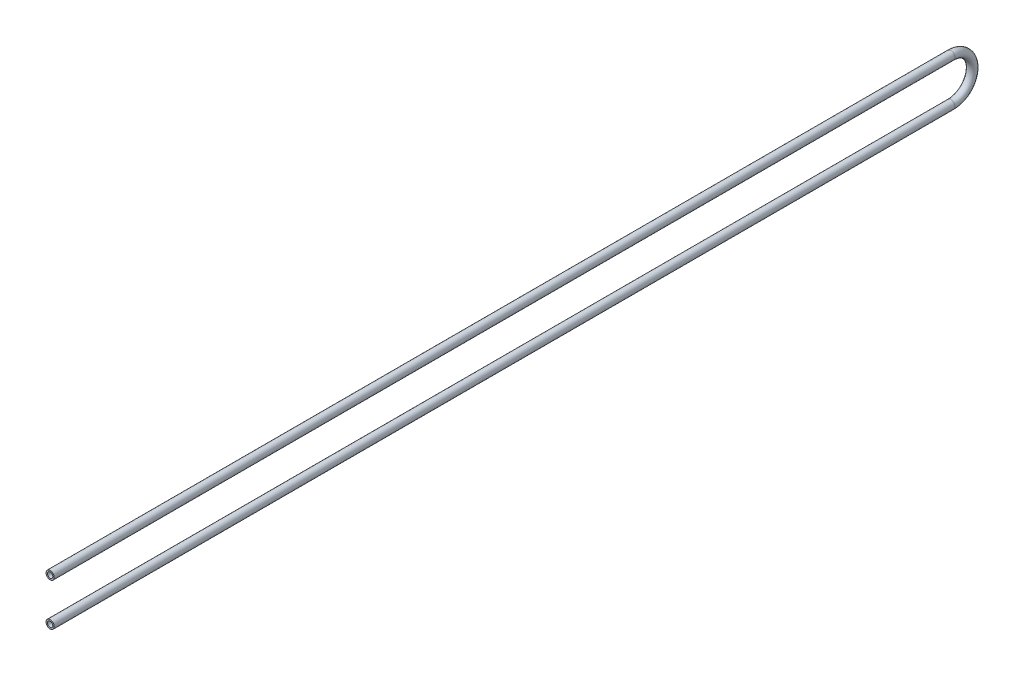
ISO-10303-21;
HEADER;
FILE_DESCRIPTION(('STEP AP214'),'2;1');
FILE_NAME('part.step','',(''),(''),'','','');
FILE_SCHEMA(('AUTOMOTIVE_DESIGN { 1 0 10303 214 1 1 1 1 }'));
ENDSEC;
DATA;
#1=APPLICATION_CONTEXT('core data for automotive mechanical design processes');
#2=APPLICATION_PROTOCOL_DEFINITION('international standard','automotive_design',2000,#1);
#3=PRODUCT_CONTEXT('',#1,'mechanical');
#4=PRODUCT('Part','Part','',(#3));
#5=PRODUCT_RELATED_PRODUCT_CATEGORY('part','',(#4));
#6=PRODUCT_DEFINITION_FORMATION('','',#4);
#7=PRODUCT_DEFINITION_CONTEXT('part definition',#1,'design');
#8=PRODUCT_DEFINITION('design','',#6,#7);
#9=PRODUCT_DEFINITION_SHAPE('','',#8);
#10=(LENGTH_UNIT() NAMED_UNIT(*) SI_UNIT(.MILLI.,.METRE.));
#11=(NAMED_UNIT(*) PLANE_ANGLE_UNIT() SI_UNIT($,.RADIAN.));
#12=(NAMED_UNIT(*) SI_UNIT($,.STERADIAN.) SOLID_ANGLE_UNIT());
#13=UNCERTAINTY_MEASURE_WITH_UNIT(LENGTH_MEASURE(1.E-05),#10,'distance_accuracy_value','');
#14=(GEOMETRIC_REPRESENTATION_CONTEXT(3) GLOBAL_UNCERTAINTY_ASSIGNED_CONTEXT((#13)) GLOBAL_UNIT_ASSIGNED_CONTEXT((#10,
#11,#12)) REPRESENTATION_CONTEXT('',''));
#15=CARTESIAN_POINT('',(0.,0.,0.));
#16=DIRECTION('',(0.,0.,1.));
#17=DIRECTION('',(1.,0.,0.));
#18=AXIS2_PLACEMENT_3D('',#15,#16,#17);
#19=CARTESIAN_POINT('',(0.,55.0000000000003,0.));
#20=DIRECTION('',(0.,0.,-1.));
#21=DIRECTION('',(0.,1.,0.));
#22=AXIS2_PLACEMENT_3D('',#19,#20,#21);
#23=CYLINDRICAL_SURFACE('',#22,10.65);
#24=CARTESIAN_POINT('',(0.,55.,-2325.));
#25=DIRECTION('',(0.,0.,1.));
#26=DIRECTION('',(1.,0.,0.));
#27=AXIS2_PLACEMENT_3D('',#24,#25,#26);
#28=CIRCLE('',#27,10.65);
#29=CARTESIAN_POINT('',(0.,65.65,-2325.));
#30=VERTEX_POINT('',#29);
#31=EDGE_CURVE('E55',#30,#30,#28,.T.);
#32=ORIENTED_EDGE('',*,*,#31,.T.);
#33=EDGE_LOOP('',(#32));
#34=FACE_BOUND('',#33,.T.);
#35=CARTESIAN_POINT('',(0.,55.0000000000003,0.));
#36=DIRECTION('',(0.,0.,1.));
#37=DIRECTION('',(1.,0.,0.));
#38=AXIS2_PLACEMENT_3D('',#35,#36,#37);
#39=CIRCLE('',#38,10.65);
#40=CARTESIAN_POINT('',(10.65,55.0000000000003,0.));
#41=VERTEX_POINT('',#40);
#42=EDGE_CURVE('E53',#41,#41,#39,.T.);
#43=ORIENTED_EDGE('',*,*,#42,.F.);
#44=EDGE_LOOP('',(#43));
#45=FACE_BOUND('',#44,.T.);
#46=ADVANCED_FACE('F32',(#34,#45),#23,.T.);
#47=CARTESIAN_POINT('',(0.,0.,-2325.));
#48=DIRECTION('',(-1.,0.,0.));
#49=DIRECTION('',(0.,0.,1.));
#50=AXIS2_PLACEMENT_3D('',#47,#48,#49);
#51=TOROIDAL_SURFACE('',#50,55.,10.65);
#52=CARTESIAN_POINT('',(0.,-55.,-2325.));
#53=DIRECTION('',(0.,0.,-1.));
#54=DIRECTION('',(1.,0.,0.));
#55=AXIS2_PLACEMENT_3D('',#52,#53,#54);
#56=CIRCLE('',#55,10.65);
#57=CARTESIAN_POINT('',(0.,-65.65,-2325.));
#58=VERTEX_POINT('',#57);
#59=EDGE_CURVE('E36',#58,#58,#56,.T.);
#60=CARTESIAN_POINT('',(0.,0.,-2325.));
#61=DIRECTION('',(-1.,0.,0.));
#62=DIRECTION('',(0.,0.,1.));
#63=AXIS2_PLACEMENT_3D('',#60,#61,#62);
#64=CIRCLE('',#63,65.65);
#65=EDGE_CURVE('',#30,#58,#64,.T.);
#66=ORIENTED_EDGE('',*,*,#31,.F.);
#67=ORIENTED_EDGE('',*,*,#59,.T.);
#68=ORIENTED_EDGE('',*,*,#65,.T.);
#69=ORIENTED_EDGE('',*,*,#65,.F.);
#70=EDGE_LOOP('',(#66,#68,#67,#69));
#71=FACE_BOUND('',#70,.T.);
#72=ADVANCED_FACE('F62',(#71),#51,.T.);
#73=CARTESIAN_POINT('',(0.,-55.,-2325.));
#74=DIRECTION('',(0.,0.,1.));
#75=DIRECTION('',(0.,-1.,0.));
#76=AXIS2_PLACEMENT_3D('',#73,#74,#75);
#77=CYLINDRICAL_SURFACE('',#76,10.65);
#78=CARTESIAN_POINT('',(0.,-55.0000000000003,0.));
#79=DIRECTION('',(0.,0.,-1.));
#80=DIRECTION('',(1.,0.,0.));
#81=AXIS2_PLACEMENT_3D('',#78,#79,#80);
#82=CIRCLE('',#81,10.65);
#83=CARTESIAN_POINT('',(10.65,-55.0000000000003,0.));
#84=VERTEX_POINT('',#83);
#85=EDGE_CURVE('E49',#84,#84,#82,.T.);
#86=ORIENTED_EDGE('',*,*,#85,.T.);
#87=EDGE_LOOP('',(#86));
#88=FACE_BOUND('',#87,.T.);
#89=ORIENTED_EDGE('',*,*,#59,.F.);
#90=EDGE_LOOP('',(#89));
#91=FACE_BOUND('',#90,.T.);
#92=ADVANCED_FACE('F34',(#88,#91),#77,.T.);
#93=CARTESIAN_POINT('',(0.,55.0000000000003,0.));
#94=DIRECTION('',(0.,0.,1.));
#95=DIRECTION('',(1.,0.,0.));
#96=AXIS2_PLACEMENT_3D('',#93,#94,#95);
#97=PLANE('',#96);
#98=CARTESIAN_POINT('',(0.,55.0000000000003,0.));
#99=DIRECTION('',(0.,0.,1.));
#100=DIRECTION('',(1.,0.,0.));
#101=AXIS2_PLACEMENT_3D('',#98,#99,#100);
#102=CIRCLE('',#101,6.92);
#103=CARTESIAN_POINT('',(6.92,55.0000000000003,0.));
#104=VERTEX_POINT('',#103);
#105=EDGE_CURVE('E52',#104,#104,#102,.F.);
#106=ORIENTED_EDGE('',*,*,#105,.T.);
#107=EDGE_LOOP('',(#106));
#108=FACE_BOUND('',#107,.T.);
#109=ORIENTED_EDGE('',*,*,#42,.T.);
#110=EDGE_LOOP('',(#109));
#111=FACE_BOUND('',#110,.T.);
#112=ADVANCED_FACE('F66',(#108,#111),#97,.T.);
#113=CARTESIAN_POINT('',(0.,-55.0000000000003,0.));
#114=DIRECTION('',(0.,0.,-1.));
#115=DIRECTION('',(1.,0.,0.));
#116=AXIS2_PLACEMENT_3D('',#113,#114,#115);
#117=PLANE('',#116);
#118=CARTESIAN_POINT('',(0.,-55.0000000000003,0.));
#119=DIRECTION('',(0.,0.,-1.));
#120=DIRECTION('',(1.,0.,0.));
#121=AXIS2_PLACEMENT_3D('',#118,#119,#120);
#122=CIRCLE('',#121,6.92);
#123=CARTESIAN_POINT('',(6.92,-55.0000000000003,0.));
#124=VERTEX_POINT('',#123);
#125=EDGE_CURVE('E10',#124,#124,#122,.F.);
#126=ORIENTED_EDGE('',*,*,#125,.F.);
#127=EDGE_LOOP('',(#126));
#128=FACE_BOUND('',#127,.T.);
#129=ORIENTED_EDGE('',*,*,#85,.F.);
#130=EDGE_LOOP('',(#129));
#131=FACE_BOUND('',#130,.T.);
#132=ADVANCED_FACE('F72',(#128,#131),#117,.F.);
#133=CARTESIAN_POINT('',(0.,55.0000000000003,0.));
#134=DIRECTION('',(0.,0.,-1.));
#135=DIRECTION('',(0.,1.,0.));
#136=AXIS2_PLACEMENT_3D('',#133,#134,#135);
#137=CYLINDRICAL_SURFACE('',#136,6.92);
#138=CARTESIAN_POINT('',(0.,55.,-2325.));
#139=DIRECTION('',(0.,0.,1.));
#140=DIRECTION('',(1.,0.,0.));
#141=AXIS2_PLACEMENT_3D('',#138,#139,#140);
#142=CIRCLE('',#141,6.92);
#143=CARTESIAN_POINT('',(0.,61.92,-2325.));
#144=VERTEX_POINT('',#143);
#145=EDGE_CURVE('E45',#144,#144,#142,.F.);
#146=ORIENTED_EDGE('',*,*,#145,.T.);
#147=EDGE_LOOP('',(#146));
#148=FACE_BOUND('',#147,.T.);
#149=ORIENTED_EDGE('',*,*,#105,.F.);
#150=EDGE_LOOP('',(#149));
#151=FACE_BOUND('',#150,.T.);
#152=ADVANCED_FACE('F82',(#148,#151),#137,.F.);
#153=CARTESIAN_POINT('',(0.,0.,-2325.));
#154=DIRECTION('',(-1.,0.,0.));
#155=DIRECTION('',(0.,0.,1.));
#156=AXIS2_PLACEMENT_3D('',#153,#154,#155);
#157=TOROIDAL_SURFACE('',#156,55.,6.92);
#158=CARTESIAN_POINT('',(0.,-55.,-2325.));
#159=DIRECTION('',(0.,0.,-1.));
#160=DIRECTION('',(1.,0.,0.));
#161=AXIS2_PLACEMENT_3D('',#158,#159,#160);
#162=CIRCLE('',#161,6.92);
#163=CARTESIAN_POINT('',(0.,-61.92,-2325.));
#164=VERTEX_POINT('',#163);
#165=EDGE_CURVE('E40',#164,#164,#162,.F.);
#166=CARTESIAN_POINT('',(0.,0.,-2325.));
#167=DIRECTION('',(-1.,0.,0.));
#168=DIRECTION('',(0.,0.,1.));
#169=AXIS2_PLACEMENT_3D('',#166,#167,#168);
#170=CIRCLE('',#169,61.92);
#171=EDGE_CURVE('',#144,#164,#170,.T.);
#172=ORIENTED_EDGE('',*,*,#145,.F.);
#173=ORIENTED_EDGE('',*,*,#165,.T.);
#174=ORIENTED_EDGE('',*,*,#171,.T.);
#175=ORIENTED_EDGE('',*,*,#171,.F.);
#176=EDGE_LOOP('',(#172,#174,#173,#175));
#177=FACE_BOUND('',#176,.T.);
#178=ADVANCED_FACE('F77',(#177),#157,.F.);
#179=CARTESIAN_POINT('',(0.,-55.,-2325.));
#180=DIRECTION('',(0.,0.,1.));
#181=DIRECTION('',(0.,-1.,0.));
#182=AXIS2_PLACEMENT_3D('',#179,#180,#181);
#183=CYLINDRICAL_SURFACE('',#182,6.92);
#184=ORIENTED_EDGE('',*,*,#125,.T.);
#185=EDGE_LOOP('',(#184));
#186=FACE_BOUND('',#185,.T.);
#187=ORIENTED_EDGE('',*,*,#165,.F.);
#188=EDGE_LOOP('',(#187));
#189=FACE_BOUND('',#188,.T.);
#190=ADVANCED_FACE('F75',(#186,#189),#183,.F.);
#191=CLOSED_SHELL('',(#46,#72,#92,#112,#132,#152,#178,#190));
#192=MANIFOLD_SOLID_BREP('B2',#191);
#193=ADVANCED_BREP_SHAPE_REPRESENTATION('',(#18,#192),#14);
#194=SHAPE_DEFINITION_REPRESENTATION(#9,#193);
ENDSEC;
END-ISO-10303-21;
